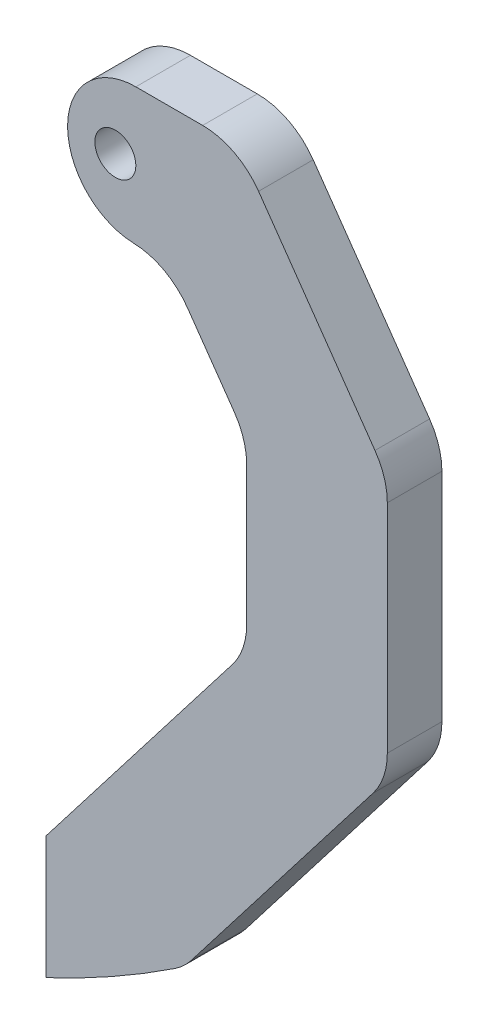
ISO-10303-21;
HEADER;
FILE_DESCRIPTION(('STEP AP214'),'2;1');
FILE_NAME('part.step','',(''),(''),'','','');
FILE_SCHEMA(('AUTOMOTIVE_DESIGN { 1 0 10303 214 1 1 1 1 }'));
ENDSEC;
DATA;
#1=APPLICATION_CONTEXT('core data for automotive mechanical design processes');
#2=APPLICATION_PROTOCOL_DEFINITION('international standard','automotive_design',2000,#1);
#3=PRODUCT_CONTEXT('',#1,'mechanical');
#4=PRODUCT('Part','Part','',(#3));
#5=PRODUCT_RELATED_PRODUCT_CATEGORY('part','',(#4));
#6=PRODUCT_DEFINITION_FORMATION('','',#4);
#7=PRODUCT_DEFINITION_CONTEXT('part definition',#1,'design');
#8=PRODUCT_DEFINITION('design','',#6,#7);
#9=PRODUCT_DEFINITION_SHAPE('','',#8);
#10=(LENGTH_UNIT() NAMED_UNIT(*) SI_UNIT(.MILLI.,.METRE.));
#11=(NAMED_UNIT(*) PLANE_ANGLE_UNIT() SI_UNIT($,.RADIAN.));
#12=(NAMED_UNIT(*) SI_UNIT($,.STERADIAN.) SOLID_ANGLE_UNIT());
#13=UNCERTAINTY_MEASURE_WITH_UNIT(LENGTH_MEASURE(1.E-05),#10,'distance_accuracy_value','');
#14=(GEOMETRIC_REPRESENTATION_CONTEXT(3) GLOBAL_UNCERTAINTY_ASSIGNED_CONTEXT((#13)) GLOBAL_UNIT_ASSIGNED_CONTEXT((#10,
#11,#12)) REPRESENTATION_CONTEXT('',''));
#15=CARTESIAN_POINT('',(0.,0.,0.));
#16=DIRECTION('',(0.,0.,1.));
#17=DIRECTION('',(1.,0.,0.));
#18=AXIS2_PLACEMENT_3D('',#15,#16,#17);
#19=CARTESIAN_POINT('',(-55.972467637369,-13.2557624114187,8.));
#20=DIRECTION('',(0.,0.,1.));
#21=DIRECTION('',(1.,0.,0.));
#22=AXIS2_PLACEMENT_3D('',#19,#20,#21);
#23=PLANE('',#22);
#24=DIRECTION('',(-1.,0.,0.));
#25=VECTOR('',#24,1.);
#26=CARTESIAN_POINT('',(10.1475516436565,-27.8731874357723,8.));
#27=LINE('',#26,#25);
#28=CARTESIAN_POINT('',(29.941881138139,-27.8731874357723,8.));
#29=VERTEX_POINT('',#28);
#30=CARTESIAN_POINT('',(20.1475516436565,-27.8731874357723,8.));
#31=VERTEX_POINT('',#30);
#32=EDGE_CURVE('E206',#29,#31,#27,.T.);
#33=ORIENTED_EDGE('',*,*,#32,.T.);
#34=CARTESIAN_POINT('',(20.1475516436565,-37.8731874357724,8.));
#35=DIRECTION('',(0.,0.,1.));
#36=DIRECTION('',(1.,0.,0.));
#37=AXIS2_PLACEMENT_3D('',#34,#35,#36);
#38=CIRCLE('',#37,10.);
#39=CARTESIAN_POINT('',(10.1475516436565,-37.8731874357724,8.));
#40=VERTEX_POINT('',#39);
#41=EDGE_CURVE('E40',#31,#40,#38,.T.);
#42=ORIENTED_EDGE('',*,*,#41,.T.);
#43=DIRECTION('',(0.,-1.,0.));
#44=VECTOR('',#43,1.);
#45=CARTESIAN_POINT('',(10.1475516436565,-47.8731874357723,8.));
#46=LINE('',#45,#44);
#47=CARTESIAN_POINT('',(10.1475516436565,-37.882707281748,8.));
#48=VERTEX_POINT('',#47);
#49=EDGE_CURVE('E208',#40,#48,#46,.T.);
#50=ORIENTED_EDGE('',*,*,#49,.T.);
#51=CARTESIAN_POINT('',(20.1475516436565,-37.882707281748,8.));
#52=DIRECTION('',(0.,0.,1.));
#53=DIRECTION('',(1.,0.,0.));
#54=AXIS2_PLACEMENT_3D('',#51,#52,#53);
#55=CIRCLE('',#54,10.);
#56=CARTESIAN_POINT('',(19.8390458853803,-47.8779473587602,8.));
#57=VERTEX_POINT('',#56);
#58=EDGE_CURVE('E47',#48,#57,#55,.T.);
#59=ORIENTED_EDGE('',*,*,#58,.T.);
#60=CARTESIAN_POINT('',(19.530540127104,-57.8731874357723,8.));
#61=DIRECTION('',(0.,0.,1.));
#62=DIRECTION('',(1.,0.,0.));
#63=AXIS2_PLACEMENT_3D('',#60,#61,#62);
#64=CIRCLE('',#63,10.);
#65=CARTESIAN_POINT('',(27.722060569994,-52.1374230722619,8.));
#66=VERTEX_POINT('',#65);
#67=EDGE_CURVE('E298',#57,#66,#64,.F.);
#68=ORIENTED_EDGE('',*,*,#67,.T.);
#69=DIRECTION('',(0.573576436351044,-0.819152044288993,0.));
#70=VECTOR('',#69,1.);
#71=CARTESIAN_POINT('',(24.7362106326215,-47.8731874357723,8.));
#72=LINE('',#71,#70);
#73=CARTESIAN_POINT('',(34.5803798144335,-61.9321180308094,8.));
#74=VERTEX_POINT('',#73);
#75=EDGE_CURVE('E210',#66,#74,#72,.T.);
#76=ORIENTED_EDGE('',*,*,#75,.T.);
#77=CARTESIAN_POINT('',(26.3888593715436,-67.6678823943198,8.));
#78=DIRECTION('',(0.,0.,1.));
#79=DIRECTION('',(1.,0.,0.));
#80=AXIS2_PLACEMENT_3D('',#77,#78,#79);
#81=CIRCLE('',#80,10.);
#82=CARTESIAN_POINT('',(36.3888593715436,-67.6678823943198,8.));
#83=VERTEX_POINT('',#82);
#84=EDGE_CURVE('E293',#74,#83,#81,.F.);
#85=ORIENTED_EDGE('',*,*,#84,.T.);
#86=DIRECTION('',(0.,-1.,0.));
#87=VECTOR('',#86,1.);
#88=CARTESIAN_POINT('',(36.3888593715436,-64.51489450553,8.));
#89=LINE('',#88,#87);
#90=CARTESIAN_POINT('',(36.3888593715436,-87.9776533458563,8.));
#91=VERTEX_POINT('',#90);
#92=EDGE_CURVE('E177',#83,#91,#89,.T.);
#93=ORIENTED_EDGE('',*,*,#92,.T.);
#94=CARTESIAN_POINT('',(26.3888593715436,-87.9776533458563,8.));
#95=DIRECTION('',(0.,0.,1.));
#96=DIRECTION('',(1.,0.,0.));
#97=AXIS2_PLACEMENT_3D('',#94,#95,#96);
#98=CIRCLE('',#97,10.);
#99=CARTESIAN_POINT('',(34.3072474373391,-94.0849547498699,8.));
#100=VERTEX_POINT('',#99);
#101=EDGE_CURVE('E173',#91,#100,#98,.F.);
#102=ORIENTED_EDGE('',*,*,#101,.T.);
#103=DIRECTION('',(-0.610730140401356,-0.791838806579559,0.));
#104=VECTOR('',#103,1.);
#105=CARTESIAN_POINT('',(6.9976263269741,-129.493093889622,8.));
#106=LINE('',#105,#104);
#107=CARTESIAN_POINT('',(6.9976263269741,-129.493093889622,8.));
#108=VERTEX_POINT('',#107);
#109=EDGE_CURVE('E164',#100,#108,#106,.T.);
#110=ORIENTED_EDGE('',*,*,#109,.T.);
#111=DIRECTION('',(0.,-1.,0.));
#112=VECTOR('',#111,1.);
#113=CARTESIAN_POINT('',(6.9976263269741,-147.493093889622,8.));
#114=LINE('',#113,#112);
#115=CARTESIAN_POINT('',(6.9976263269741,-147.493093889622,8.));
#116=VERTEX_POINT('',#115);
#117=EDGE_CURVE('E169',#108,#116,#114,.T.);
#118=ORIENTED_EDGE('',*,*,#117,.T.);
#119=CARTESIAN_POINT('',(-55.972467637369,-13.2557624114187,8.));
#120=DIRECTION('',(0.,0.,1.));
#121=DIRECTION('',(1.,0.,0.));
#122=AXIS2_PLACEMENT_3D('',#119,#120,#121);
#123=CIRCLE('',#122,148.273038332217);
#124=CARTESIAN_POINT('',(25.8667476223318,-136.897328003025,8.));
#125=VERTEX_POINT('',#124);
#126=EDGE_CURVE('E192',#116,#125,#123,.T.);
#127=ORIENTED_EDGE('',*,*,#126,.T.);
#128=CARTESIAN_POINT('',(20.3472535740387,-128.558551986675,8.));
#129=DIRECTION('',(0.,0.,1.));
#130=DIRECTION('',(1.,0.,0.));
#131=AXIS2_PLACEMENT_3D('',#128,#129,#130);
#132=CIRCLE('',#131,10.);
#133=CARTESIAN_POINT('',(28.2656416398344,-134.665853390689,8.));
#134=VERTEX_POINT('',#133);
#135=EDGE_CURVE('E256',#125,#134,#132,.T.);
#136=ORIENTED_EDGE('',*,*,#135,.T.);
#137=DIRECTION('',(0.610730140401355,0.791838806579559,0.));
#138=VECTOR('',#137,1.);
#139=CARTESIAN_POINT('',(56.9976263269741,-97.4135565736762,8.));
#140=LINE('',#139,#138);
#141=CARTESIAN_POINT('',(54.9160143927697,-100.112459085118,8.));
#142=VERTEX_POINT('',#141);
#143=EDGE_CURVE('E194',#134,#142,#140,.T.);
#144=ORIENTED_EDGE('',*,*,#143,.T.);
#145=CARTESIAN_POINT('',(46.9976263269741,-94.005157681104,8.));
#146=DIRECTION('',(0.,0.,1.));
#147=DIRECTION('',(1.,0.,0.));
#148=AXIS2_PLACEMENT_3D('',#145,#146,#147);
#149=CIRCLE('',#148,10.);
#150=CARTESIAN_POINT('',(56.9976263269741,-94.005157681104,8.));
#151=VERTEX_POINT('',#150);
#152=EDGE_CURVE('E258',#142,#151,#149,.T.);
#153=ORIENTED_EDGE('',*,*,#152,.T.);
#154=DIRECTION('',(0.,1.,0.));
#155=VECTOR('',#154,1.);
#156=CARTESIAN_POINT('',(56.9976263269741,-59.0783280419189,8.));
#157=LINE('',#156,#155);
#158=CARTESIAN_POINT('',(56.9976263269741,-62.2313159307087,8.));
#159=VERTEX_POINT('',#158);
#160=EDGE_CURVE('E200',#151,#159,#157,.T.);
#161=ORIENTED_EDGE('',*,*,#160,.T.);
#162=CARTESIAN_POINT('',(46.9976263269741,-62.2313159307087,8.));
#163=DIRECTION('',(0.,0.,1.));
#164=DIRECTION('',(1.,0.,0.));
#165=AXIS2_PLACEMENT_3D('',#162,#163,#164);
#166=CIRCLE('',#165,10.);
#167=CARTESIAN_POINT('',(55.189146769864,-56.4955515671983,8.));
#168=VERTEX_POINT('',#167);
#169=EDGE_CURVE('E260',#159,#168,#166,.T.);
#170=ORIENTED_EDGE('',*,*,#169,.T.);
#171=DIRECTION('',(-0.573576436351044,0.819152044288993,0.));
#172=VECTOR('',#171,1.);
#173=CARTESIAN_POINT('',(35.1475516436565,-27.8731874357723,8.));
#174=LINE('',#173,#172);
#175=CARTESIAN_POINT('',(38.1334015810289,-32.1374230722619,8.));
#176=VERTEX_POINT('',#175);
#177=EDGE_CURVE('E203',#168,#176,#174,.T.);
#178=ORIENTED_EDGE('',*,*,#177,.T.);
#179=CARTESIAN_POINT('',(29.941881138139,-37.8731874357724,8.));
#180=DIRECTION('',(0.,0.,1.));
#181=DIRECTION('',(1.,0.,0.));
#182=AXIS2_PLACEMENT_3D('',#179,#180,#181);
#183=CIRCLE('',#182,10.);
#184=EDGE_CURVE('E262',#176,#29,#183,.T.);
#185=ORIENTED_EDGE('',*,*,#184,.T.);
#186=EDGE_LOOP('',(#33,#42,#50,#59,#68,#76,#85,#93,#102,#110,#118,#127,#136,#144,#153,#161,#170,
#178,#185));
#187=FACE_BOUND('',#186,.T.);
#188=CARTESIAN_POINT('',(17.1475516436565,-37.8731874357724,8.));
#189=DIRECTION('',(0.,0.,1.));
#190=DIRECTION('',(1.,0.,0.));
#191=AXIS2_PLACEMENT_3D('',#188,#189,#190);
#192=CIRCLE('',#191,3.);
#193=CARTESIAN_POINT('',(20.1475516436565,-37.8731874357724,8.));
#194=VERTEX_POINT('',#193);
#195=EDGE_CURVE('E216',#194,#194,#192,.T.);
#196=ORIENTED_EDGE('',*,*,#195,.F.);
#197=EDGE_LOOP('',(#196));
#198=FACE_BOUND('',#197,.T.);
#199=ADVANCED_FACE('F32',(#187,#198),#23,.T.);
#200=CARTESIAN_POINT('',(-55.972467637369,-13.2557624114187,0.));
#201=DIRECTION('',(0.,0.,1.));
#202=DIRECTION('',(1.,0.,0.));
#203=AXIS2_PLACEMENT_3D('',#200,#201,#202);
#204=PLANE('',#203);
#205=DIRECTION('',(0.,-1.,0.));
#206=VECTOR('',#205,1.);
#207=CARTESIAN_POINT('',(10.1475516436565,-47.8731874357723,0.));
#208=LINE('',#207,#206);
#209=CARTESIAN_POINT('',(10.1475516436565,-37.8731874357724,0.));
#210=VERTEX_POINT('',#209);
#211=CARTESIAN_POINT('',(10.1475516436565,-37.882707281748,0.));
#212=VERTEX_POINT('',#211);
#213=EDGE_CURVE('E234',#210,#212,#208,.T.);
#214=ORIENTED_EDGE('',*,*,#213,.F.);
#215=CARTESIAN_POINT('',(20.1475516436565,-37.8731874357724,0.));
#216=DIRECTION('',(0.,0.,1.));
#217=DIRECTION('',(1.,0.,0.));
#218=AXIS2_PLACEMENT_3D('',#215,#216,#217);
#219=CIRCLE('',#218,10.);
#220=CARTESIAN_POINT('',(20.1475516436565,-27.8731874357723,0.));
#221=VERTEX_POINT('',#220);
#222=EDGE_CURVE('E307',#210,#221,#219,.F.);
#223=ORIENTED_EDGE('',*,*,#222,.T.);
#224=DIRECTION('',(-1.,0.,0.));
#225=VECTOR('',#224,1.);
#226=CARTESIAN_POINT('',(10.1475516436565,-27.8731874357723,0.));
#227=LINE('',#226,#225);
#228=CARTESIAN_POINT('',(29.941881138139,-27.8731874357723,0.));
#229=VERTEX_POINT('',#228);
#230=EDGE_CURVE('E232',#229,#221,#227,.T.);
#231=ORIENTED_EDGE('',*,*,#230,.F.);
#232=CARTESIAN_POINT('',(29.941881138139,-37.8731874357724,0.));
#233=DIRECTION('',(0.,0.,1.));
#234=DIRECTION('',(1.,0.,0.));
#235=AXIS2_PLACEMENT_3D('',#232,#233,#234);
#236=CIRCLE('',#235,10.);
#237=CARTESIAN_POINT('',(38.1334015810289,-32.1374230722619,0.));
#238=VERTEX_POINT('',#237);
#239=EDGE_CURVE('E249',#229,#238,#236,.F.);
#240=ORIENTED_EDGE('',*,*,#239,.T.);
#241=DIRECTION('',(-0.573576436351044,0.819152044288993,0.));
#242=VECTOR('',#241,1.);
#243=CARTESIAN_POINT('',(35.1475516436565,-27.8731874357723,0.));
#244=LINE('',#243,#242);
#245=CARTESIAN_POINT('',(55.189146769864,-56.4955515671983,0.));
#246=VERTEX_POINT('',#245);
#247=EDGE_CURVE('E229',#246,#238,#244,.T.);
#248=ORIENTED_EDGE('',*,*,#247,.F.);
#249=CARTESIAN_POINT('',(46.9976263269741,-62.2313159307087,0.));
#250=DIRECTION('',(0.,0.,1.));
#251=DIRECTION('',(1.,0.,0.));
#252=AXIS2_PLACEMENT_3D('',#249,#250,#251);
#253=CIRCLE('',#252,10.);
#254=CARTESIAN_POINT('',(56.9976263269741,-62.2313159307087,0.));
#255=VERTEX_POINT('',#254);
#256=EDGE_CURVE('E247',#246,#255,#253,.F.);
#257=ORIENTED_EDGE('',*,*,#256,.T.);
#258=DIRECTION('',(0.,1.,0.));
#259=VECTOR('',#258,1.);
#260=CARTESIAN_POINT('',(56.9976263269741,-59.0783280419189,0.));
#261=LINE('',#260,#259);
#262=CARTESIAN_POINT('',(56.9976263269741,-94.005157681104,0.));
#263=VERTEX_POINT('',#262);
#264=EDGE_CURVE('E226',#263,#255,#261,.T.);
#265=ORIENTED_EDGE('',*,*,#264,.F.);
#266=CARTESIAN_POINT('',(46.9976263269741,-94.005157681104,0.));
#267=DIRECTION('',(0.,0.,1.));
#268=DIRECTION('',(1.,0.,0.));
#269=AXIS2_PLACEMENT_3D('',#266,#267,#268);
#270=CIRCLE('',#269,10.);
#271=CARTESIAN_POINT('',(54.9160143927697,-100.112459085118,0.));
#272=VERTEX_POINT('',#271);
#273=EDGE_CURVE('E245',#263,#272,#270,.F.);
#274=ORIENTED_EDGE('',*,*,#273,.T.);
#275=DIRECTION('',(0.610730140401355,0.791838806579559,0.));
#276=VECTOR('',#275,1.);
#277=CARTESIAN_POINT('',(56.9976263269741,-97.4135565736762,0.));
#278=LINE('',#277,#276);
#279=CARTESIAN_POINT('',(28.2656416398344,-134.665853390689,0.));
#280=VERTEX_POINT('',#279);
#281=EDGE_CURVE('E223',#280,#272,#278,.T.);
#282=ORIENTED_EDGE('',*,*,#281,.F.);
#283=CARTESIAN_POINT('',(20.3472535740387,-128.558551986675,0.));
#284=DIRECTION('',(0.,0.,1.));
#285=DIRECTION('',(1.,0.,0.));
#286=AXIS2_PLACEMENT_3D('',#283,#284,#285);
#287=CIRCLE('',#286,10.);
#288=CARTESIAN_POINT('',(25.8667476223318,-136.897328003025,0.));
#289=VERTEX_POINT('',#288);
#290=EDGE_CURVE('E243',#280,#289,#287,.F.);
#291=ORIENTED_EDGE('',*,*,#290,.T.);
#292=CARTESIAN_POINT('',(-55.972467637369,-13.2557624114187,0.));
#293=DIRECTION('',(0.,0.,1.));
#294=DIRECTION('',(1.,0.,0.));
#295=AXIS2_PLACEMENT_3D('',#292,#293,#294);
#296=CIRCLE('',#295,148.273038332217);
#297=CARTESIAN_POINT('',(6.9976263269741,-147.493093889622,0.));
#298=VERTEX_POINT('',#297);
#299=EDGE_CURVE('E220',#298,#289,#296,.T.);
#300=ORIENTED_EDGE('',*,*,#299,.F.);
#301=DIRECTION('',(0.,-1.,0.));
#302=VECTOR('',#301,1.);
#303=CARTESIAN_POINT('',(6.9976263269741,-147.493093889622,0.));
#304=LINE('',#303,#302);
#305=CARTESIAN_POINT('',(6.9976263269741,-129.493093889622,0.));
#306=VERTEX_POINT('',#305);
#307=EDGE_CURVE('E218',#306,#298,#304,.T.);
#308=ORIENTED_EDGE('',*,*,#307,.F.);
#309=DIRECTION('',(-0.610730140401356,-0.791838806579559,0.));
#310=VECTOR('',#309,1.);
#311=CARTESIAN_POINT('',(6.9976263269741,-129.493093889622,0.));
#312=LINE('',#311,#310);
#313=CARTESIAN_POINT('',(34.3072474373391,-94.0849547498699,0.));
#314=VERTEX_POINT('',#313);
#315=EDGE_CURVE('E183',#314,#306,#312,.T.);
#316=ORIENTED_EDGE('',*,*,#315,.F.);
#317=CARTESIAN_POINT('',(26.3888593715436,-87.9776533458563,0.));
#318=DIRECTION('',(0.,0.,1.));
#319=DIRECTION('',(1.,0.,0.));
#320=AXIS2_PLACEMENT_3D('',#317,#318,#319);
#321=CIRCLE('',#320,10.);
#322=CARTESIAN_POINT('',(36.3888593715436,-87.9776533458563,0.));
#323=VERTEX_POINT('',#322);
#324=EDGE_CURVE('E288',#314,#323,#321,.T.);
#325=ORIENTED_EDGE('',*,*,#324,.T.);
#326=DIRECTION('',(0.,-1.,0.));
#327=VECTOR('',#326,1.);
#328=CARTESIAN_POINT('',(36.3888593715436,-64.51489450553,0.));
#329=LINE('',#328,#327);
#330=CARTESIAN_POINT('',(36.3888593715436,-67.6678823943198,0.));
#331=VERTEX_POINT('',#330);
#332=EDGE_CURVE('E213',#331,#323,#329,.T.);
#333=ORIENTED_EDGE('',*,*,#332,.F.);
#334=CARTESIAN_POINT('',(26.3888593715436,-67.6678823943198,0.));
#335=DIRECTION('',(0.,0.,1.));
#336=DIRECTION('',(1.,0.,0.));
#337=AXIS2_PLACEMENT_3D('',#334,#335,#336);
#338=CIRCLE('',#337,10.);
#339=CARTESIAN_POINT('',(34.5803798144335,-61.9321180308094,0.));
#340=VERTEX_POINT('',#339);
#341=EDGE_CURVE('E291',#331,#340,#338,.T.);
#342=ORIENTED_EDGE('',*,*,#341,.T.);
#343=DIRECTION('',(0.573576436351044,-0.819152044288993,0.));
#344=VECTOR('',#343,1.);
#345=CARTESIAN_POINT('',(24.7362106326215,-47.8731874357723,0.));
#346=LINE('',#345,#344);
#347=CARTESIAN_POINT('',(27.722060569994,-52.1374230722619,0.));
#348=VERTEX_POINT('',#347);
#349=EDGE_CURVE('E237',#348,#340,#346,.T.);
#350=ORIENTED_EDGE('',*,*,#349,.F.);
#351=CARTESIAN_POINT('',(19.530540127104,-57.8731874357723,0.));
#352=DIRECTION('',(0.,0.,1.));
#353=DIRECTION('',(1.,0.,0.));
#354=AXIS2_PLACEMENT_3D('',#351,#352,#353);
#355=CIRCLE('',#354,10.);
#356=CARTESIAN_POINT('',(19.8390458853803,-47.8779473587602,0.));
#357=VERTEX_POINT('',#356);
#358=EDGE_CURVE('E295',#348,#357,#355,.T.);
#359=ORIENTED_EDGE('',*,*,#358,.T.);
#360=CARTESIAN_POINT('',(20.1475516436565,-37.882707281748,0.));
#361=DIRECTION('',(0.,0.,1.));
#362=DIRECTION('',(1.,0.,0.));
#363=AXIS2_PLACEMENT_3D('',#360,#361,#362);
#364=CIRCLE('',#363,10.);
#365=EDGE_CURVE('E305',#357,#212,#364,.F.);
#366=ORIENTED_EDGE('',*,*,#365,.T.);
#367=EDGE_LOOP('',(#214,#223,#231,#240,#248,#257,#265,#274,#282,#291,#300,#308,#316,#325,#333,
#342,#350,#359,#366));
#368=FACE_BOUND('',#367,.T.);
#369=CARTESIAN_POINT('',(17.1475516436565,-37.8731874357724,0.));
#370=DIRECTION('',(0.,0.,1.));
#371=DIRECTION('',(1.,0.,0.));
#372=AXIS2_PLACEMENT_3D('',#369,#370,#371);
#373=CIRCLE('',#372,3.);
#374=CARTESIAN_POINT('',(20.1475516436565,-37.8731874357724,0.));
#375=VERTEX_POINT('',#374);
#376=EDGE_CURVE('E556',#375,#375,#373,.T.);
#377=ORIENTED_EDGE('',*,*,#376,.T.);
#378=EDGE_LOOP('',(#377));
#379=FACE_BOUND('',#378,.T.);
#380=ADVANCED_FACE('F321',(#368,#379),#204,.F.);
#381=CARTESIAN_POINT('',(36.3888593715436,-64.51489450553,8.));
#382=DIRECTION('',(1.,0.,0.));
#383=DIRECTION('',(0.,1.,0.));
#384=AXIS2_PLACEMENT_3D('',#381,#382,#383);
#385=PLANE('',#384);
#386=ORIENTED_EDGE('',*,*,#332,.T.);
#387=DIRECTION('',(0.,0.,-1.));
#388=VECTOR('',#387,1.);
#389=CARTESIAN_POINT('',(36.3888593715436,-87.9776533458563,8.));
#390=LINE('',#389,#388);
#391=EDGE_CURVE('E281',#323,#91,#390,.F.);
#392=ORIENTED_EDGE('',*,*,#391,.T.);
#393=ORIENTED_EDGE('',*,*,#92,.F.);
#394=DIRECTION('',(0.,0.,-1.));
#395=VECTOR('',#394,1.);
#396=CARTESIAN_POINT('',(36.3888593715436,-67.6678823943198,0.));
#397=LINE('',#396,#395);
#398=EDGE_CURVE('E278',#83,#331,#397,.T.);
#399=ORIENTED_EDGE('',*,*,#398,.T.);
#400=EDGE_LOOP('',(#386,#392,#393,#399));
#401=FACE_BOUND('',#400,.T.);
#402=ADVANCED_FACE('F372',(#401),#385,.F.);
#403=CARTESIAN_POINT('',(6.9976263269741,-129.493093889622,8.));
#404=DIRECTION('',(0.791838806579559,-0.610730140401356,0.));
#405=DIRECTION('',(0.610730140401356,0.791838806579559,0.));
#406=AXIS2_PLACEMENT_3D('',#403,#404,#405);
#407=PLANE('',#406);
#408=ORIENTED_EDGE('',*,*,#109,.F.);
#409=DIRECTION('',(0.,0.,-1.));
#410=VECTOR('',#409,1.);
#411=CARTESIAN_POINT('',(34.3072474373392,-94.0849547498699,0.));
#412=LINE('',#411,#410);
#413=EDGE_CURVE('E276',#100,#314,#412,.T.);
#414=ORIENTED_EDGE('',*,*,#413,.T.);
#415=ORIENTED_EDGE('',*,*,#315,.T.);
#416=DIRECTION('',(0.,0.,-1.));
#417=VECTOR('',#416,1.);
#418=CARTESIAN_POINT('',(6.9976263269741,-129.493093889622,8.));
#419=LINE('',#418,#417);
#420=EDGE_CURVE('E180',#108,#306,#419,.T.);
#421=ORIENTED_EDGE('',*,*,#420,.F.);
#422=EDGE_LOOP('',(#408,#414,#415,#421));
#423=FACE_BOUND('',#422,.T.);
#424=ADVANCED_FACE('F181',(#423),#407,.F.);
#425=CARTESIAN_POINT('',(6.9976263269741,-147.493093889622,8.));
#426=DIRECTION('',(1.,0.,0.));
#427=DIRECTION('',(0.,0.,-1.));
#428=AXIS2_PLACEMENT_3D('',#425,#426,#427);
#429=PLANE('',#428);
#430=ORIENTED_EDGE('',*,*,#307,.T.);
#431=DIRECTION('',(0.,0.,-1.));
#432=VECTOR('',#431,1.);
#433=CARTESIAN_POINT('',(6.9976263269741,-147.493093889622,8.));
#434=LINE('',#433,#432);
#435=EDGE_CURVE('E187',#116,#298,#434,.T.);
#436=ORIENTED_EDGE('',*,*,#435,.F.);
#437=ORIENTED_EDGE('',*,*,#117,.F.);
#438=ORIENTED_EDGE('',*,*,#420,.T.);
#439=EDGE_LOOP('',(#430,#436,#437,#438));
#440=FACE_BOUND('',#439,.T.);
#441=ADVANCED_FACE('F189',(#440),#429,.F.);
#442=CARTESIAN_POINT('',(-55.972467637369,-13.2557624114187,8.));
#443=DIRECTION('',(0.,0.,-1.));
#444=DIRECTION('',(-1.,0.,0.));
#445=AXIS2_PLACEMENT_3D('',#442,#443,#444);
#446=CYLINDRICAL_SURFACE('',#445,148.273038332217);
#447=ORIENTED_EDGE('',*,*,#299,.T.);
#448=DIRECTION('',(0.,0.,-1.));
#449=VECTOR('',#448,1.);
#450=CARTESIAN_POINT('',(25.8667476223318,-136.897328003025,8.));
#451=LINE('',#450,#449);
#452=EDGE_CURVE('E274',#289,#125,#451,.F.);
#453=ORIENTED_EDGE('',*,*,#452,.T.);
#454=ORIENTED_EDGE('',*,*,#126,.F.);
#455=ORIENTED_EDGE('',*,*,#435,.T.);
#456=EDGE_LOOP('',(#447,#453,#454,#455));
#457=FACE_BOUND('',#456,.T.);
#458=ADVANCED_FACE('F358',(#457),#446,.T.);
#459=CARTESIAN_POINT('',(56.9976263269741,-97.4135565736762,8.));
#460=DIRECTION('',(-0.791838806579559,0.610730140401355,0.));
#461=DIRECTION('',(-0.610730140401355,-0.79183880657956,0.));
#462=AXIS2_PLACEMENT_3D('',#459,#460,#461);
#463=PLANE('',#462);
#464=ORIENTED_EDGE('',*,*,#281,.T.);
#465=DIRECTION('',(0.,0.,-1.));
#466=VECTOR('',#465,1.);
#467=CARTESIAN_POINT('',(54.9160143927697,-100.112459085118,8.));
#468=LINE('',#467,#466);
#469=EDGE_CURVE('E272',#272,#142,#468,.F.);
#470=ORIENTED_EDGE('',*,*,#469,.T.);
#471=ORIENTED_EDGE('',*,*,#143,.F.);
#472=DIRECTION('',(0.,0.,-1.));
#473=VECTOR('',#472,1.);
#474=CARTESIAN_POINT('',(28.2656416398343,-134.665853390689,8.));
#475=LINE('',#474,#473);
#476=EDGE_CURVE('E269',#134,#280,#475,.T.);
#477=ORIENTED_EDGE('',*,*,#476,.T.);
#478=EDGE_LOOP('',(#464,#470,#471,#477));
#479=FACE_BOUND('',#478,.T.);
#480=ADVANCED_FACE('F349',(#479),#463,.F.);
#481=CARTESIAN_POINT('',(56.9976263269741,-59.0783280419189,8.));
#482=DIRECTION('',(-1.,0.,0.));
#483=DIRECTION('',(0.,-1.,0.));
#484=AXIS2_PLACEMENT_3D('',#481,#482,#483);
#485=PLANE('',#484);
#486=ORIENTED_EDGE('',*,*,#264,.T.);
#487=DIRECTION('',(0.,0.,-1.));
#488=VECTOR('',#487,1.);
#489=CARTESIAN_POINT('',(56.9976263269741,-62.2313159307087,8.));
#490=LINE('',#489,#488);
#491=EDGE_CURVE('E267',#255,#159,#490,.F.);
#492=ORIENTED_EDGE('',*,*,#491,.T.);
#493=ORIENTED_EDGE('',*,*,#160,.F.);
#494=DIRECTION('',(0.,0.,-1.));
#495=VECTOR('',#494,1.);
#496=CARTESIAN_POINT('',(56.9976263269741,-94.005157681104,8.));
#497=LINE('',#496,#495);
#498=EDGE_CURVE('E264',#151,#263,#497,.T.);
#499=ORIENTED_EDGE('',*,*,#498,.T.);
#500=EDGE_LOOP('',(#486,#492,#493,#499));
#501=FACE_BOUND('',#500,.T.);
#502=ADVANCED_FACE('F340',(#501),#485,.F.);
#503=CARTESIAN_POINT('',(35.1475516436565,-27.8731874357723,8.));
#504=DIRECTION('',(-0.819152044288993,-0.573576436351044,0.));
#505=DIRECTION('',(0.573576436351044,-0.819152044288993,0.));
#506=AXIS2_PLACEMENT_3D('',#503,#504,#505);
#507=PLANE('',#506);
#508=ORIENTED_EDGE('',*,*,#247,.T.);
#509=DIRECTION('',(0.,0.,-1.));
#510=VECTOR('',#509,1.);
#511=CARTESIAN_POINT('',(38.1334015810289,-32.1374230722619,8.));
#512=LINE('',#511,#510);
#513=EDGE_CURVE('E254',#238,#176,#512,.F.);
#514=ORIENTED_EDGE('',*,*,#513,.T.);
#515=ORIENTED_EDGE('',*,*,#177,.F.);
#516=DIRECTION('',(0.,0.,-1.));
#517=VECTOR('',#516,1.);
#518=CARTESIAN_POINT('',(55.189146769864,-56.4955515671983,8.));
#519=LINE('',#518,#517);
#520=EDGE_CURVE('E251',#168,#246,#519,.T.);
#521=ORIENTED_EDGE('',*,*,#520,.T.);
#522=EDGE_LOOP('',(#508,#514,#515,#521));
#523=FACE_BOUND('',#522,.T.);
#524=ADVANCED_FACE('F331',(#523),#507,.F.);
#525=CARTESIAN_POINT('',(10.1475516436565,-27.8731874357723,8.));
#526=DIRECTION('',(0.,-1.,0.));
#527=DIRECTION('',(0.,0.,-1.));
#528=AXIS2_PLACEMENT_3D('',#525,#526,#527);
#529=PLANE('',#528);
#530=ORIENTED_EDGE('',*,*,#230,.T.);
#531=DIRECTION('',(0.,0.,-1.));
#532=VECTOR('',#531,1.);
#533=CARTESIAN_POINT('',(20.1475516436565,-27.8731874357723,8.));
#534=LINE('',#533,#532);
#535=EDGE_CURVE('E55',#221,#31,#534,.F.);
#536=ORIENTED_EDGE('',*,*,#535,.T.);
#537=ORIENTED_EDGE('',*,*,#32,.F.);
#538=DIRECTION('',(0.,0.,-1.));
#539=VECTOR('',#538,1.);
#540=CARTESIAN_POINT('',(29.941881138139,-27.8731874357723,8.));
#541=LINE('',#540,#539);
#542=EDGE_CURVE('E186',#29,#229,#541,.T.);
#543=ORIENTED_EDGE('',*,*,#542,.T.);
#544=EDGE_LOOP('',(#530,#536,#537,#543));
#545=FACE_BOUND('',#544,.T.);
#546=ADVANCED_FACE('F323',(#545),#529,.F.);
#547=CARTESIAN_POINT('',(10.1475516436565,-47.8731874357723,8.));
#548=DIRECTION('',(1.,0.,0.));
#549=DIRECTION('',(0.,1.,0.));
#550=AXIS2_PLACEMENT_3D('',#547,#548,#549);
#551=PLANE('',#550);
#552=ORIENTED_EDGE('',*,*,#49,.F.);
#553=DIRECTION('',(0.,0.,-1.));
#554=VECTOR('',#553,1.);
#555=CARTESIAN_POINT('',(10.1475516436565,-37.8731874357724,8.));
#556=LINE('',#555,#554);
#557=EDGE_CURVE('E302',#40,#210,#556,.T.);
#558=ORIENTED_EDGE('',*,*,#557,.T.);
#559=ORIENTED_EDGE('',*,*,#213,.T.);
#560=DIRECTION('',(0.,0.,1.));
#561=VECTOR('',#560,1.);
#562=CARTESIAN_POINT('',(10.1475516436565,-37.882707281748,8.));
#563=LINE('',#562,#561);
#564=EDGE_CURVE('E300',#212,#48,#563,.T.);
#565=ORIENTED_EDGE('',*,*,#564,.T.);
#566=EDGE_LOOP('',(#552,#558,#559,#565));
#567=FACE_BOUND('',#566,.T.);
#568=ADVANCED_FACE('F315',(#567),#551,.F.);
#569=CARTESIAN_POINT('',(24.7362106326215,-47.8731874357723,8.));
#570=DIRECTION('',(0.819152044288993,0.573576436351044,0.));
#571=DIRECTION('',(-0.573576436351044,0.819152044288993,0.));
#572=AXIS2_PLACEMENT_3D('',#569,#570,#571);
#573=PLANE('',#572);
#574=ORIENTED_EDGE('',*,*,#349,.T.);
#575=DIRECTION('',(0.,0.,-1.));
#576=VECTOR('',#575,1.);
#577=CARTESIAN_POINT('',(34.5803798144335,-61.9321180308094,8.));
#578=LINE('',#577,#576);
#579=EDGE_CURVE('E286',#340,#74,#578,.F.);
#580=ORIENTED_EDGE('',*,*,#579,.T.);
#581=ORIENTED_EDGE('',*,*,#75,.F.);
#582=DIRECTION('',(0.,0.,-1.));
#583=VECTOR('',#582,1.);
#584=CARTESIAN_POINT('',(27.722060569994,-52.1374230722619,0.));
#585=LINE('',#584,#583);
#586=EDGE_CURVE('E283',#66,#348,#585,.T.);
#587=ORIENTED_EDGE('',*,*,#586,.T.);
#588=EDGE_LOOP('',(#574,#580,#581,#587));
#589=FACE_BOUND('',#588,.T.);
#590=ADVANCED_FACE('F377',(#589),#573,.F.);
#591=CARTESIAN_POINT('',(17.1475516436565,-37.8731874357724,8.));
#592=DIRECTION('',(0.,0.,-1.));
#593=DIRECTION('',(-1.,0.,0.));
#594=AXIS2_PLACEMENT_3D('',#591,#592,#593);
#595=CYLINDRICAL_SURFACE('',#594,3.);
#596=ORIENTED_EDGE('',*,*,#195,.T.);
#597=EDGE_LOOP('',(#596));
#598=FACE_BOUND('',#597,.T.);
#599=ORIENTED_EDGE('',*,*,#376,.F.);
#600=EDGE_LOOP('',(#599));
#601=FACE_BOUND('',#600,.T.);
#602=ADVANCED_FACE('F375',(#598,#601),#595,.F.);
#603=CARTESIAN_POINT('',(29.941881138139,-37.8731874357724,8.));
#604=DIRECTION('',(0.,0.,-1.));
#605=DIRECTION('',(-1.,0.,0.));
#606=AXIS2_PLACEMENT_3D('',#603,#604,#605);
#607=CYLINDRICAL_SURFACE('',#606,10.);
#608=ORIENTED_EDGE('',*,*,#184,.F.);
#609=ORIENTED_EDGE('',*,*,#513,.F.);
#610=ORIENTED_EDGE('',*,*,#239,.F.);
#611=ORIENTED_EDGE('',*,*,#542,.F.);
#612=EDGE_LOOP('',(#608,#609,#610,#611));
#613=FACE_BOUND('',#612,.T.);
#614=ADVANCED_FACE('F327',(#613),#607,.T.);
#615=CARTESIAN_POINT('',(46.9976263269741,-62.2313159307087,8.));
#616=DIRECTION('',(0.,0.,-1.));
#617=DIRECTION('',(-1.,0.,0.));
#618=AXIS2_PLACEMENT_3D('',#615,#616,#617);
#619=CYLINDRICAL_SURFACE('',#618,10.);
#620=ORIENTED_EDGE('',*,*,#169,.F.);
#621=ORIENTED_EDGE('',*,*,#491,.F.);
#622=ORIENTED_EDGE('',*,*,#256,.F.);
#623=ORIENTED_EDGE('',*,*,#520,.F.);
#624=EDGE_LOOP('',(#620,#621,#622,#623));
#625=FACE_BOUND('',#624,.T.);
#626=ADVANCED_FACE('F336',(#625),#619,.T.);
#627=CARTESIAN_POINT('',(46.9976263269741,-94.005157681104,8.));
#628=DIRECTION('',(0.,0.,-1.));
#629=DIRECTION('',(-1.,0.,0.));
#630=AXIS2_PLACEMENT_3D('',#627,#628,#629);
#631=CYLINDRICAL_SURFACE('',#630,10.);
#632=ORIENTED_EDGE('',*,*,#152,.F.);
#633=ORIENTED_EDGE('',*,*,#469,.F.);
#634=ORIENTED_EDGE('',*,*,#273,.F.);
#635=ORIENTED_EDGE('',*,*,#498,.F.);
#636=EDGE_LOOP('',(#632,#633,#634,#635));
#637=FACE_BOUND('',#636,.T.);
#638=ADVANCED_FACE('F345',(#637),#631,.T.);
#639=CARTESIAN_POINT('',(20.3472535740387,-128.558551986675,8.));
#640=DIRECTION('',(0.,0.,-1.));
#641=DIRECTION('',(-1.,0.,0.));
#642=AXIS2_PLACEMENT_3D('',#639,#640,#641);
#643=CYLINDRICAL_SURFACE('',#642,10.);
#644=ORIENTED_EDGE('',*,*,#135,.F.);
#645=ORIENTED_EDGE('',*,*,#452,.F.);
#646=ORIENTED_EDGE('',*,*,#290,.F.);
#647=ORIENTED_EDGE('',*,*,#476,.F.);
#648=EDGE_LOOP('',(#644,#645,#646,#647));
#649=FACE_BOUND('',#648,.T.);
#650=ADVANCED_FACE('F354',(#649),#643,.T.);
#651=CARTESIAN_POINT('',(26.3888593715436,-87.9776533458563,8.));
#652=DIRECTION('',(0.,0.,1.));
#653=DIRECTION('',(1.,0.,0.));
#654=AXIS2_PLACEMENT_3D('',#651,#652,#653);
#655=CYLINDRICAL_SURFACE('',#654,10.);
#656=ORIENTED_EDGE('',*,*,#101,.F.);
#657=ORIENTED_EDGE('',*,*,#391,.F.);
#658=ORIENTED_EDGE('',*,*,#324,.F.);
#659=ORIENTED_EDGE('',*,*,#413,.F.);
#660=EDGE_LOOP('',(#656,#657,#658,#659));
#661=FACE_BOUND('',#660,.T.);
#662=ADVANCED_FACE('F442',(#661),#655,.F.);
#663=CARTESIAN_POINT('',(26.3888593715436,-67.6678823943198,8.));
#664=DIRECTION('',(0.,0.,1.));
#665=DIRECTION('',(1.,0.,0.));
#666=AXIS2_PLACEMENT_3D('',#663,#664,#665);
#667=CYLINDRICAL_SURFACE('',#666,10.);
#668=ORIENTED_EDGE('',*,*,#84,.F.);
#669=ORIENTED_EDGE('',*,*,#579,.F.);
#670=ORIENTED_EDGE('',*,*,#341,.F.);
#671=ORIENTED_EDGE('',*,*,#398,.F.);
#672=EDGE_LOOP('',(#668,#669,#670,#671));
#673=FACE_BOUND('',#672,.T.);
#674=ADVANCED_FACE('F449',(#673),#667,.F.);
#675=CARTESIAN_POINT('',(19.530540127104,-57.8731874357723,8.));
#676=DIRECTION('',(0.,0.,1.));
#677=DIRECTION('',(1.,0.,0.));
#678=AXIS2_PLACEMENT_3D('',#675,#676,#677);
#679=CYLINDRICAL_SURFACE('',#678,10.);
#680=ORIENTED_EDGE('',*,*,#67,.F.);
#681=DIRECTION('',(0.,0.,1.));
#682=VECTOR('',#681,1.);
#683=CARTESIAN_POINT('',(19.8390458853803,-47.8779473587602,8.));
#684=LINE('',#683,#682);
#685=EDGE_CURVE('E11',#57,#357,#684,.F.);
#686=ORIENTED_EDGE('',*,*,#685,.T.);
#687=ORIENTED_EDGE('',*,*,#358,.F.);
#688=ORIENTED_EDGE('',*,*,#586,.F.);
#689=EDGE_LOOP('',(#680,#686,#687,#688));
#690=FACE_BOUND('',#689,.T.);
#691=ADVANCED_FACE('F457',(#690),#679,.F.);
#692=CARTESIAN_POINT('',(20.1475516436565,-37.8731874357724,8.));
#693=DIRECTION('',(0.,0.,-1.));
#694=DIRECTION('',(-1.,0.,0.));
#695=AXIS2_PLACEMENT_3D('',#692,#693,#694);
#696=CYLINDRICAL_SURFACE('',#695,10.);
#697=ORIENTED_EDGE('',*,*,#41,.F.);
#698=ORIENTED_EDGE('',*,*,#535,.F.);
#699=ORIENTED_EDGE('',*,*,#222,.F.);
#700=ORIENTED_EDGE('',*,*,#557,.F.);
#701=EDGE_LOOP('',(#697,#698,#699,#700));
#702=FACE_BOUND('',#701,.T.);
#703=ADVANCED_FACE('F318',(#702),#696,.T.);
#704=CARTESIAN_POINT('',(20.1475516436565,-37.882707281748,8.));
#705=DIRECTION('',(0.,0.,1.));
#706=DIRECTION('',(1.,0.,0.));
#707=AXIS2_PLACEMENT_3D('',#704,#705,#706);
#708=CYLINDRICAL_SURFACE('',#707,10.);
#709=ORIENTED_EDGE('',*,*,#58,.F.);
#710=ORIENTED_EDGE('',*,*,#564,.F.);
#711=ORIENTED_EDGE('',*,*,#365,.F.);
#712=ORIENTED_EDGE('',*,*,#685,.F.);
#713=EDGE_LOOP('',(#709,#710,#711,#712));
#714=FACE_BOUND('',#713,.T.);
#715=ADVANCED_FACE('F34',(#714),#708,.T.);
#716=CLOSED_SHELL('',(#199,#380,#402,#424,#441,#458,#480,#502,#524,#546,#568,#590,#602,#614,
#626,#638,#650,#662,#674,#691,#703,#715));
#717=MANIFOLD_SOLID_BREP('B2',#716);
#718=ADVANCED_BREP_SHAPE_REPRESENTATION('',(#18,#717),#14);
#719=SHAPE_DEFINITION_REPRESENTATION(#9,#718);
ENDSEC;
END-ISO-10303-21;
